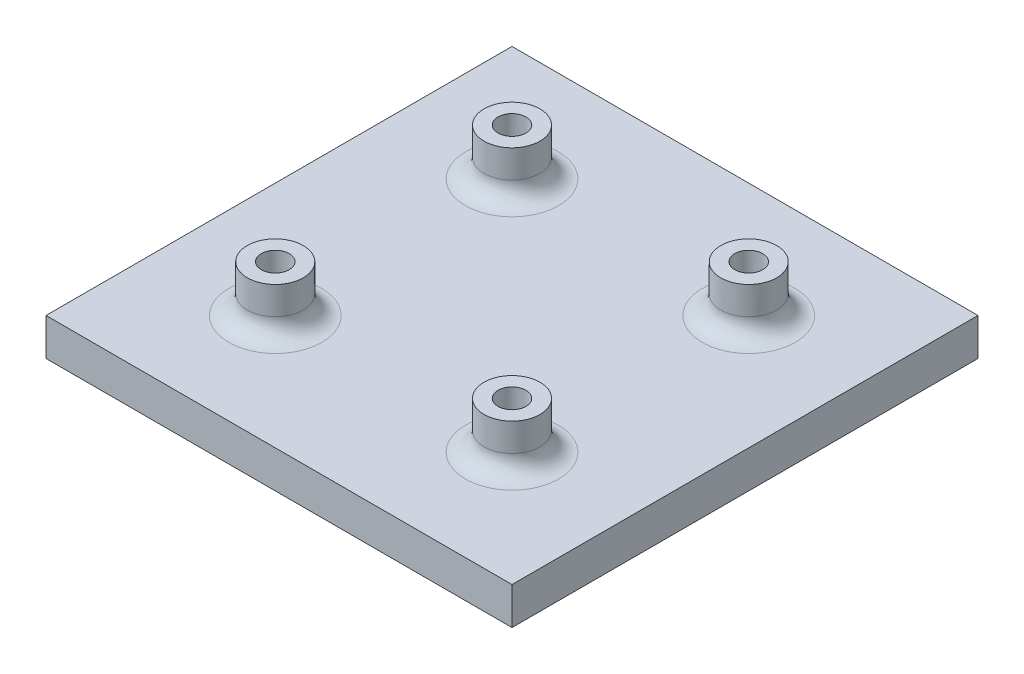
ISO-10303-21;
HEADER;
FILE_DESCRIPTION(('STEP AP214'),'2;1');
FILE_NAME('part.step','',(''),(''),'','','');
FILE_SCHEMA(('AUTOMOTIVE_DESIGN { 1 0 10303 214 1 1 1 1 }'));
ENDSEC;
DATA;
#1=APPLICATION_CONTEXT('core data for automotive mechanical design processes');
#2=APPLICATION_PROTOCOL_DEFINITION('international standard','automotive_design',2000,#1);
#3=PRODUCT_CONTEXT('',#1,'mechanical');
#4=PRODUCT('Part','Part','',(#3));
#5=PRODUCT_RELATED_PRODUCT_CATEGORY('part','',(#4));
#6=PRODUCT_DEFINITION_FORMATION('','',#4);
#7=PRODUCT_DEFINITION_CONTEXT('part definition',#1,'design');
#8=PRODUCT_DEFINITION('design','',#6,#7);
#9=PRODUCT_DEFINITION_SHAPE('','',#8);
#10=(LENGTH_UNIT() NAMED_UNIT(*) SI_UNIT(.MILLI.,.METRE.));
#11=(NAMED_UNIT(*) PLANE_ANGLE_UNIT() SI_UNIT($,.RADIAN.));
#12=(NAMED_UNIT(*) SI_UNIT($,.STERADIAN.) SOLID_ANGLE_UNIT());
#13=UNCERTAINTY_MEASURE_WITH_UNIT(LENGTH_MEASURE(1.E-05),#10,'distance_accuracy_value','');
#14=(GEOMETRIC_REPRESENTATION_CONTEXT(3) GLOBAL_UNCERTAINTY_ASSIGNED_CONTEXT((#13)) GLOBAL_UNIT_ASSIGNED_CONTEXT((#10,
#11,#12)) REPRESENTATION_CONTEXT('',''));
#15=CARTESIAN_POINT('',(0.,0.,0.));
#16=DIRECTION('',(0.,0.,1.));
#17=DIRECTION('',(1.,0.,0.));
#18=AXIS2_PLACEMENT_3D('',#15,#16,#17);
#19=CARTESIAN_POINT('',(12.3,0.,-37.7));
#20=DIRECTION('',(0.,1.,0.));
#21=DIRECTION('',(0.,0.,1.));
#22=AXIS2_PLACEMENT_3D('',#19,#20,#21);
#23=CYLINDRICAL_SURFACE('',#22,1.5);
#24=CARTESIAN_POINT('',(12.3,9.,-37.7));
#25=DIRECTION('',(0.,1.,0.));
#26=DIRECTION('',(0.,0.,1.));
#27=AXIS2_PLACEMENT_3D('',#24,#25,#26);
#28=CIRCLE('',#27,1.5);
#29=CARTESIAN_POINT('',(12.3,9.,-36.2));
#30=VERTEX_POINT('',#29);
#31=EDGE_CURVE('E169',#30,#30,#28,.T.);
#32=ORIENTED_EDGE('',*,*,#31,.T.);
#33=EDGE_LOOP('',(#32));
#34=FACE_BOUND('',#33,.T.);
#35=CARTESIAN_POINT('',(12.3,4.,-37.7));
#36=DIRECTION('',(0.,-1.,0.));
#37=DIRECTION('',(0.,0.,-1.));
#38=AXIS2_PLACEMENT_3D('',#35,#36,#37);
#39=CIRCLE('',#38,1.5);
#40=CARTESIAN_POINT('',(12.3,4.,-39.2));
#41=VERTEX_POINT('',#40);
#42=EDGE_CURVE('E11',#41,#41,#39,.F.);
#43=ORIENTED_EDGE('',*,*,#42,.F.);
#44=EDGE_LOOP('',(#43));
#45=FACE_BOUND('',#44,.T.);
#46=ADVANCED_FACE('F36',(#34,#45),#23,.F.);
#47=CARTESIAN_POINT('',(37.7,0.,-12.3));
#48=DIRECTION('',(0.,1.,0.));
#49=DIRECTION('',(0.,0.,1.));
#50=AXIS2_PLACEMENT_3D('',#47,#48,#49);
#51=CYLINDRICAL_SURFACE('',#50,1.5);
#52=CARTESIAN_POINT('',(37.7,9.,-12.3));
#53=DIRECTION('',(0.,1.,0.));
#54=DIRECTION('',(0.,0.,-1.));
#55=AXIS2_PLACEMENT_3D('',#52,#53,#54);
#56=CIRCLE('',#55,1.5);
#57=CARTESIAN_POINT('',(37.7,9.,-13.8));
#58=VERTEX_POINT('',#57);
#59=EDGE_CURVE('E157',#58,#58,#56,.T.);
#60=ORIENTED_EDGE('',*,*,#59,.T.);
#61=EDGE_LOOP('',(#60));
#62=FACE_BOUND('',#61,.T.);
#63=CARTESIAN_POINT('',(37.7,4.,-12.3));
#64=DIRECTION('',(0.,-1.,0.));
#65=DIRECTION('',(0.,0.,-1.));
#66=AXIS2_PLACEMENT_3D('',#63,#64,#65);
#67=CIRCLE('',#66,1.5);
#68=CARTESIAN_POINT('',(37.7,4.,-13.8));
#69=VERTEX_POINT('',#68);
#70=EDGE_CURVE('E46',#69,#69,#67,.F.);
#71=ORIENTED_EDGE('',*,*,#70,.F.);
#72=EDGE_LOOP('',(#71));
#73=FACE_BOUND('',#72,.T.);
#74=ADVANCED_FACE('F192',(#62,#73),#51,.F.);
#75=CARTESIAN_POINT('',(37.7,0.,-37.7));
#76=DIRECTION('',(0.,1.,0.));
#77=DIRECTION('',(0.,0.,1.));
#78=AXIS2_PLACEMENT_3D('',#75,#76,#77);
#79=CYLINDRICAL_SURFACE('',#78,1.5);
#80=CARTESIAN_POINT('',(37.7,9.,-37.7));
#81=DIRECTION('',(0.,-1.,0.));
#82=DIRECTION('',(0.,0.,1.));
#83=AXIS2_PLACEMENT_3D('',#80,#81,#82);
#84=CIRCLE('',#83,1.5);
#85=CARTESIAN_POINT('',(37.7,9.,-36.2));
#86=VERTEX_POINT('',#85);
#87=EDGE_CURVE('E151',#86,#86,#84,.T.);
#88=ORIENTED_EDGE('',*,*,#87,.F.);
#89=EDGE_LOOP('',(#88));
#90=FACE_BOUND('',#89,.T.);
#91=CARTESIAN_POINT('',(37.7,4.,-37.7));
#92=DIRECTION('',(0.,-1.,0.));
#93=DIRECTION('',(0.,0.,-1.));
#94=AXIS2_PLACEMENT_3D('',#91,#92,#93);
#95=CIRCLE('',#94,1.5);
#96=CARTESIAN_POINT('',(37.7,4.,-39.2));
#97=VERTEX_POINT('',#96);
#98=EDGE_CURVE('E142',#97,#97,#95,.F.);
#99=ORIENTED_EDGE('',*,*,#98,.F.);
#100=EDGE_LOOP('',(#99));
#101=FACE_BOUND('',#100,.T.);
#102=ADVANCED_FACE('F198',(#90,#101),#79,.F.);
#103=CARTESIAN_POINT('',(12.3,0.,-12.3));
#104=DIRECTION('',(0.,1.,0.));
#105=DIRECTION('',(0.,0.,1.));
#106=AXIS2_PLACEMENT_3D('',#103,#104,#105);
#107=CYLINDRICAL_SURFACE('',#106,1.5);
#108=CARTESIAN_POINT('',(12.3,9.,-12.3));
#109=DIRECTION('',(0.,-1.,0.));
#110=DIRECTION('',(0.,0.,-1.));
#111=AXIS2_PLACEMENT_3D('',#108,#109,#110);
#112=CIRCLE('',#111,1.5);
#113=CARTESIAN_POINT('',(12.3,9.,-13.8));
#114=VERTEX_POINT('',#113);
#115=EDGE_CURVE('E163',#114,#114,#112,.T.);
#116=ORIENTED_EDGE('',*,*,#115,.F.);
#117=EDGE_LOOP('',(#116));
#118=FACE_BOUND('',#117,.T.);
#119=CARTESIAN_POINT('',(12.3,4.,-12.3));
#120=DIRECTION('',(0.,-1.,0.));
#121=DIRECTION('',(0.,0.,-1.));
#122=AXIS2_PLACEMENT_3D('',#119,#120,#121);
#123=CIRCLE('',#122,1.5);
#124=CARTESIAN_POINT('',(12.3,4.,-13.8));
#125=VERTEX_POINT('',#124);
#126=EDGE_CURVE('E138',#125,#125,#123,.F.);
#127=ORIENTED_EDGE('',*,*,#126,.F.);
#128=EDGE_LOOP('',(#127));
#129=FACE_BOUND('',#128,.T.);
#130=ADVANCED_FACE('F207',(#118,#129),#107,.F.);
#131=CARTESIAN_POINT('',(0.,4.,0.));
#132=DIRECTION('',(0.,-1.,0.));
#133=DIRECTION('',(0.,0.,-1.));
#134=AXIS2_PLACEMENT_3D('',#131,#132,#133);
#135=PLANE('',#134);
#136=CARTESIAN_POINT('',(37.7,4.,-12.3));
#137=DIRECTION('',(0.,-1.,0.));
#138=DIRECTION('',(0.,0.,-1.));
#139=AXIS2_PLACEMENT_3D('',#136,#137,#138);
#140=CIRCLE('',#139,5.);
#141=CARTESIAN_POINT('',(37.7,4.,-17.3));
#142=VERTEX_POINT('',#141);
#143=EDGE_CURVE('E128',#142,#142,#140,.T.);
#144=ORIENTED_EDGE('',*,*,#143,.T.);
#145=EDGE_LOOP('',(#144));
#146=FACE_BOUND('',#145,.T.);
#147=CARTESIAN_POINT('',(37.7,4.,-37.7));
#148=DIRECTION('',(0.,-1.,0.));
#149=DIRECTION('',(0.,0.,-1.));
#150=AXIS2_PLACEMENT_3D('',#147,#148,#149);
#151=CIRCLE('',#150,5.);
#152=CARTESIAN_POINT('',(37.7,4.,-42.7));
#153=VERTEX_POINT('',#152);
#154=EDGE_CURVE('E125',#153,#153,#151,.T.);
#155=ORIENTED_EDGE('',*,*,#154,.T.);
#156=EDGE_LOOP('',(#155));
#157=FACE_BOUND('',#156,.T.);
#158=CARTESIAN_POINT('',(12.3,4.,-37.7));
#159=DIRECTION('',(0.,-1.,0.));
#160=DIRECTION('',(0.,0.,-1.));
#161=AXIS2_PLACEMENT_3D('',#158,#159,#160);
#162=CIRCLE('',#161,5.);
#163=CARTESIAN_POINT('',(12.3,4.,-42.7));
#164=VERTEX_POINT('',#163);
#165=EDGE_CURVE('E122',#164,#164,#162,.T.);
#166=ORIENTED_EDGE('',*,*,#165,.T.);
#167=EDGE_LOOP('',(#166));
#168=FACE_BOUND('',#167,.T.);
#169=CARTESIAN_POINT('',(12.3,4.,-12.3));
#170=DIRECTION('',(0.,-1.,0.));
#171=DIRECTION('',(0.,0.,-1.));
#172=AXIS2_PLACEMENT_3D('',#169,#170,#171);
#173=CIRCLE('',#172,5.);
#174=CARTESIAN_POINT('',(12.3,4.,-17.3));
#175=VERTEX_POINT('',#174);
#176=EDGE_CURVE('E119',#175,#175,#173,.T.);
#177=ORIENTED_EDGE('',*,*,#176,.T.);
#178=EDGE_LOOP('',(#177));
#179=FACE_BOUND('',#178,.T.);
#180=DIRECTION('',(0.,0.,1.));
#181=VECTOR('',#180,1.);
#182=CARTESIAN_POINT('',(0.,4.,0.));
#183=LINE('',#182,#181);
#184=CARTESIAN_POINT('',(0.,4.,-50.));
#185=VERTEX_POINT('',#184);
#186=CARTESIAN_POINT('',(0.,4.,0.));
#187=VERTEX_POINT('',#186);
#188=EDGE_CURVE('E91',#185,#187,#183,.T.);
#189=ORIENTED_EDGE('',*,*,#188,.T.);
#190=DIRECTION('',(1.,0.,0.));
#191=VECTOR('',#190,1.);
#192=CARTESIAN_POINT('',(0.,4.,0.));
#193=LINE('',#192,#191);
#194=CARTESIAN_POINT('',(50.,4.,0.));
#195=VERTEX_POINT('',#194);
#196=EDGE_CURVE('E86',#187,#195,#193,.T.);
#197=ORIENTED_EDGE('',*,*,#196,.T.);
#198=DIRECTION('',(0.,0.,-1.));
#199=VECTOR('',#198,1.);
#200=CARTESIAN_POINT('',(50.,4.,0.));
#201=LINE('',#200,#199);
#202=CARTESIAN_POINT('',(50.,4.,-50.));
#203=VERTEX_POINT('',#202);
#204=EDGE_CURVE('E89',#195,#203,#201,.T.);
#205=ORIENTED_EDGE('',*,*,#204,.T.);
#206=DIRECTION('',(-1.,0.,0.));
#207=VECTOR('',#206,1.);
#208=CARTESIAN_POINT('',(0.,4.,-50.));
#209=LINE('',#208,#207);
#210=EDGE_CURVE('E55',#203,#185,#209,.T.);
#211=ORIENTED_EDGE('',*,*,#210,.T.);
#212=EDGE_LOOP('',(#189,#197,#205,#211));
#213=FACE_BOUND('',#212,.T.);
#214=ADVANCED_FACE('F87',(#146,#157,#168,#179,#213),#135,.F.);
#215=CARTESIAN_POINT('',(0.,4.,0.));
#216=DIRECTION('',(1.,0.,0.));
#217=DIRECTION('',(0.,0.,-1.));
#218=AXIS2_PLACEMENT_3D('',#215,#216,#217);
#219=PLANE('',#218);
#220=DIRECTION('',(0.,0.,1.));
#221=VECTOR('',#220,1.);
#222=CARTESIAN_POINT('',(0.,0.,0.));
#223=LINE('',#222,#221);
#224=CARTESIAN_POINT('',(0.,0.,-50.));
#225=VERTEX_POINT('',#224);
#226=CARTESIAN_POINT('',(0.,0.,0.));
#227=VERTEX_POINT('',#226);
#228=EDGE_CURVE('E106',#225,#227,#223,.T.);
#229=ORIENTED_EDGE('',*,*,#228,.T.);
#230=DIRECTION('',(0.,-1.,0.));
#231=VECTOR('',#230,1.);
#232=CARTESIAN_POINT('',(0.,4.,0.));
#233=LINE('',#232,#231);
#234=EDGE_CURVE('E97',#187,#227,#233,.T.);
#235=ORIENTED_EDGE('',*,*,#234,.F.);
#236=ORIENTED_EDGE('',*,*,#188,.F.);
#237=DIRECTION('',(0.,-1.,0.));
#238=VECTOR('',#237,1.);
#239=CARTESIAN_POINT('',(0.,4.,-50.));
#240=LINE('',#239,#238);
#241=EDGE_CURVE('E102',#185,#225,#240,.T.);
#242=ORIENTED_EDGE('',*,*,#241,.T.);
#243=EDGE_LOOP('',(#229,#235,#236,#242));
#244=FACE_BOUND('',#243,.T.);
#245=ADVANCED_FACE('F206',(#244),#219,.F.);
#246=CARTESIAN_POINT('',(0.,4.,0.));
#247=DIRECTION('',(0.,0.,-1.));
#248=DIRECTION('',(-1.,0.,0.));
#249=AXIS2_PLACEMENT_3D('',#246,#247,#248);
#250=PLANE('',#249);
#251=DIRECTION('',(1.,0.,0.));
#252=VECTOR('',#251,1.);
#253=CARTESIAN_POINT('',(0.,0.,0.));
#254=LINE('',#253,#252);
#255=CARTESIAN_POINT('',(50.,0.,0.));
#256=VERTEX_POINT('',#255);
#257=EDGE_CURVE('E96',#227,#256,#254,.T.);
#258=ORIENTED_EDGE('',*,*,#257,.T.);
#259=DIRECTION('',(0.,-1.,0.));
#260=VECTOR('',#259,1.);
#261=CARTESIAN_POINT('',(50.,4.,0.));
#262=LINE('',#261,#260);
#263=EDGE_CURVE('E94',#195,#256,#262,.T.);
#264=ORIENTED_EDGE('',*,*,#263,.F.);
#265=ORIENTED_EDGE('',*,*,#196,.F.);
#266=ORIENTED_EDGE('',*,*,#234,.T.);
#267=EDGE_LOOP('',(#258,#264,#265,#266));
#268=FACE_BOUND('',#267,.T.);
#269=ADVANCED_FACE('F95',(#268),#250,.F.);
#270=CARTESIAN_POINT('',(50.,4.,0.));
#271=DIRECTION('',(-1.,0.,0.));
#272=DIRECTION('',(0.,0.,1.));
#273=AXIS2_PLACEMENT_3D('',#270,#271,#272);
#274=PLANE('',#273);
#275=DIRECTION('',(0.,0.,-1.));
#276=VECTOR('',#275,1.);
#277=CARTESIAN_POINT('',(50.,0.,0.));
#278=LINE('',#277,#276);
#279=CARTESIAN_POINT('',(50.,0.,-50.));
#280=VERTEX_POINT('',#279);
#281=EDGE_CURVE('E72',#256,#280,#278,.T.);
#282=ORIENTED_EDGE('',*,*,#281,.T.);
#283=DIRECTION('',(0.,-1.,0.));
#284=VECTOR('',#283,1.);
#285=CARTESIAN_POINT('',(50.,4.,-50.));
#286=LINE('',#285,#284);
#287=EDGE_CURVE('E98',#203,#280,#286,.T.);
#288=ORIENTED_EDGE('',*,*,#287,.F.);
#289=ORIENTED_EDGE('',*,*,#204,.F.);
#290=ORIENTED_EDGE('',*,*,#263,.T.);
#291=EDGE_LOOP('',(#282,#288,#289,#290));
#292=FACE_BOUND('',#291,.T.);
#293=ADVANCED_FACE('F100',(#292),#274,.F.);
#294=CARTESIAN_POINT('',(0.,4.,-50.));
#295=DIRECTION('',(0.,0.,1.));
#296=DIRECTION('',(1.,0.,0.));
#297=AXIS2_PLACEMENT_3D('',#294,#295,#296);
#298=PLANE('',#297);
#299=DIRECTION('',(-1.,0.,0.));
#300=VECTOR('',#299,1.);
#301=CARTESIAN_POINT('',(0.,0.,-50.));
#302=LINE('',#301,#300);
#303=EDGE_CURVE('E78',#280,#225,#302,.T.);
#304=ORIENTED_EDGE('',*,*,#303,.T.);
#305=ORIENTED_EDGE('',*,*,#241,.F.);
#306=ORIENTED_EDGE('',*,*,#210,.F.);
#307=ORIENTED_EDGE('',*,*,#287,.T.);
#308=EDGE_LOOP('',(#304,#305,#306,#307));
#309=FACE_BOUND('',#308,.T.);
#310=ADVANCED_FACE('F211',(#309),#298,.F.);
#311=CARTESIAN_POINT('',(0.,0.,0.));
#312=DIRECTION('',(0.,-1.,0.));
#313=DIRECTION('',(0.,0.,-1.));
#314=AXIS2_PLACEMENT_3D('',#311,#312,#313);
#315=PLANE('',#314);
#316=ORIENTED_EDGE('',*,*,#228,.F.);
#317=ORIENTED_EDGE('',*,*,#303,.F.);
#318=ORIENTED_EDGE('',*,*,#281,.F.);
#319=ORIENTED_EDGE('',*,*,#257,.F.);
#320=EDGE_LOOP('',(#316,#317,#318,#319));
#321=FACE_BOUND('',#320,.T.);
#322=ADVANCED_FACE('F188',(#321),#315,.T.);
#323=CARTESIAN_POINT('',(12.3,9.,-37.7));
#324=DIRECTION('',(0.,1.,0.));
#325=DIRECTION('',(0.,0.,1.));
#326=AXIS2_PLACEMENT_3D('',#323,#324,#325);
#327=PLANE('',#326);
#328=CARTESIAN_POINT('',(12.3,9.,-37.7));
#329=DIRECTION('',(0.,1.,0.));
#330=DIRECTION('',(0.,0.,1.));
#331=AXIS2_PLACEMENT_3D('',#328,#329,#330);
#332=CIRCLE('',#331,3.);
#333=CARTESIAN_POINT('',(12.3,9.,-34.7));
#334=VERTEX_POINT('',#333);
#335=EDGE_CURVE('E109',#334,#334,#332,.T.);
#336=ORIENTED_EDGE('',*,*,#335,.T.);
#337=EDGE_LOOP('',(#336));
#338=FACE_BOUND('',#337,.T.);
#339=ORIENTED_EDGE('',*,*,#31,.F.);
#340=EDGE_LOOP('',(#339));
#341=FACE_BOUND('',#340,.T.);
#342=ADVANCED_FACE('F175',(#338,#341),#327,.T.);
#343=CARTESIAN_POINT('',(12.3,9.,-37.7));
#344=DIRECTION('',(0.,-1.,0.));
#345=DIRECTION('',(0.,0.,-1.));
#346=AXIS2_PLACEMENT_3D('',#343,#344,#345);
#347=CYLINDRICAL_SURFACE('',#346,3.);
#348=CARTESIAN_POINT('',(12.3,6.,-37.7));
#349=DIRECTION('',(0.,-1.,0.));
#350=DIRECTION('',(0.,0.,-1.));
#351=AXIS2_PLACEMENT_3D('',#348,#349,#350);
#352=CIRCLE('',#351,3.);
#353=CARTESIAN_POINT('',(12.3,6.,-40.7));
#354=VERTEX_POINT('',#353);
#355=EDGE_CURVE('E133',#354,#354,#352,.F.);
#356=ORIENTED_EDGE('',*,*,#355,.T.);
#357=EDGE_LOOP('',(#356));
#358=FACE_BOUND('',#357,.T.);
#359=ORIENTED_EDGE('',*,*,#335,.F.);
#360=EDGE_LOOP('',(#359));
#361=FACE_BOUND('',#360,.T.);
#362=ADVANCED_FACE('F178',(#358,#361),#347,.T.);
#363=CARTESIAN_POINT('',(12.3,9.,-12.3));
#364=DIRECTION('',(0.,-1.,0.));
#365=DIRECTION('',(0.,0.,-1.));
#366=AXIS2_PLACEMENT_3D('',#363,#364,#365);
#367=CYLINDRICAL_SURFACE('',#366,3.);
#368=CARTESIAN_POINT('',(12.3,6.,-12.3));
#369=DIRECTION('',(0.,-1.,0.));
#370=DIRECTION('',(0.,0.,-1.));
#371=AXIS2_PLACEMENT_3D('',#368,#369,#370);
#372=CIRCLE('',#371,3.);
#373=CARTESIAN_POINT('',(12.3,6.,-15.3));
#374=VERTEX_POINT('',#373);
#375=EDGE_CURVE('E40',#374,#374,#372,.F.);
#376=ORIENTED_EDGE('',*,*,#375,.T.);
#377=EDGE_LOOP('',(#376));
#378=FACE_BOUND('',#377,.T.);
#379=CARTESIAN_POINT('',(12.3,9.,-12.3));
#380=DIRECTION('',(0.,-1.,0.));
#381=DIRECTION('',(0.,0.,-1.));
#382=AXIS2_PLACEMENT_3D('',#379,#380,#381);
#383=CIRCLE('',#382,3.);
#384=CARTESIAN_POINT('',(12.3,9.,-15.3));
#385=VERTEX_POINT('',#384);
#386=EDGE_CURVE('E166',#385,#385,#383,.T.);
#387=ORIENTED_EDGE('',*,*,#386,.T.);
#388=EDGE_LOOP('',(#387));
#389=FACE_BOUND('',#388,.T.);
#390=ADVANCED_FACE('F180',(#378,#389),#367,.T.);
#391=CARTESIAN_POINT('',(12.3,9.,-12.3));
#392=DIRECTION('',(0.,1.,0.));
#393=DIRECTION('',(0.,0.,-1.));
#394=AXIS2_PLACEMENT_3D('',#391,#392,#393);
#395=PLANE('',#394);
#396=ORIENTED_EDGE('',*,*,#115,.T.);
#397=EDGE_LOOP('',(#396));
#398=FACE_BOUND('',#397,.T.);
#399=ORIENTED_EDGE('',*,*,#386,.F.);
#400=EDGE_LOOP('',(#399));
#401=FACE_BOUND('',#400,.T.);
#402=ADVANCED_FACE('F186',(#398,#401),#395,.T.);
#403=CARTESIAN_POINT('',(37.7,9.,-12.3));
#404=DIRECTION('',(0.,1.,0.));
#405=DIRECTION('',(0.,0.,-1.));
#406=AXIS2_PLACEMENT_3D('',#403,#404,#405);
#407=PLANE('',#406);
#408=CARTESIAN_POINT('',(37.7,9.,-12.3));
#409=DIRECTION('',(0.,1.,0.));
#410=DIRECTION('',(0.,0.,-1.));
#411=AXIS2_PLACEMENT_3D('',#408,#409,#410);
#412=CIRCLE('',#411,3.);
#413=CARTESIAN_POINT('',(37.7,9.,-15.3));
#414=VERTEX_POINT('',#413);
#415=EDGE_CURVE('E160',#414,#414,#412,.T.);
#416=ORIENTED_EDGE('',*,*,#415,.T.);
#417=EDGE_LOOP('',(#416));
#418=FACE_BOUND('',#417,.T.);
#419=ORIENTED_EDGE('',*,*,#59,.F.);
#420=EDGE_LOOP('',(#419));
#421=FACE_BOUND('',#420,.T.);
#422=ADVANCED_FACE('F354',(#418,#421),#407,.T.);
#423=CARTESIAN_POINT('',(37.7,9.,-12.3));
#424=DIRECTION('',(0.,-1.,0.));
#425=DIRECTION('',(0.,0.,-1.));
#426=AXIS2_PLACEMENT_3D('',#423,#424,#425);
#427=CYLINDRICAL_SURFACE('',#426,3.);
#428=CARTESIAN_POINT('',(37.7,6.,-12.3));
#429=DIRECTION('',(0.,-1.,0.));
#430=DIRECTION('',(0.,0.,-1.));
#431=AXIS2_PLACEMENT_3D('',#428,#429,#430);
#432=CIRCLE('',#431,3.);
#433=CARTESIAN_POINT('',(37.7,6.,-15.3));
#434=VERTEX_POINT('',#433);
#435=EDGE_CURVE('E116',#434,#434,#432,.F.);
#436=ORIENTED_EDGE('',*,*,#435,.T.);
#437=EDGE_LOOP('',(#436));
#438=FACE_BOUND('',#437,.T.);
#439=ORIENTED_EDGE('',*,*,#415,.F.);
#440=EDGE_LOOP('',(#439));
#441=FACE_BOUND('',#440,.T.);
#442=ADVANCED_FACE('F344',(#438,#441),#427,.T.);
#443=CARTESIAN_POINT('',(37.7,9.,-37.7));
#444=DIRECTION('',(0.,-1.,0.));
#445=DIRECTION('',(0.,0.,-1.));
#446=AXIS2_PLACEMENT_3D('',#443,#444,#445);
#447=CYLINDRICAL_SURFACE('',#446,3.);
#448=CARTESIAN_POINT('',(37.7,6.,-37.7));
#449=DIRECTION('',(0.,-1.,0.));
#450=DIRECTION('',(0.,0.,-1.));
#451=AXIS2_PLACEMENT_3D('',#448,#449,#450);
#452=CIRCLE('',#451,3.);
#453=CARTESIAN_POINT('',(37.7,6.,-40.7));
#454=VERTEX_POINT('',#453);
#455=EDGE_CURVE('E131',#454,#454,#452,.F.);
#456=ORIENTED_EDGE('',*,*,#455,.T.);
#457=EDGE_LOOP('',(#456));
#458=FACE_BOUND('',#457,.T.);
#459=CARTESIAN_POINT('',(37.7,9.,-37.7));
#460=DIRECTION('',(0.,-1.,0.));
#461=DIRECTION('',(0.,0.,1.));
#462=AXIS2_PLACEMENT_3D('',#459,#460,#461);
#463=CIRCLE('',#462,3.);
#464=CARTESIAN_POINT('',(37.7,9.,-34.7));
#465=VERTEX_POINT('',#464);
#466=EDGE_CURVE('E154',#465,#465,#463,.T.);
#467=ORIENTED_EDGE('',*,*,#466,.T.);
#468=EDGE_LOOP('',(#467));
#469=FACE_BOUND('',#468,.T.);
#470=ADVANCED_FACE('F339',(#458,#469),#447,.T.);
#471=CARTESIAN_POINT('',(37.7,9.,-37.7));
#472=DIRECTION('',(0.,1.,0.));
#473=DIRECTION('',(0.,0.,1.));
#474=AXIS2_PLACEMENT_3D('',#471,#472,#473);
#475=PLANE('',#474);
#476=ORIENTED_EDGE('',*,*,#87,.T.);
#477=EDGE_LOOP('',(#476));
#478=FACE_BOUND('',#477,.T.);
#479=ORIENTED_EDGE('',*,*,#466,.F.);
#480=EDGE_LOOP('',(#479));
#481=FACE_BOUND('',#480,.T.);
#482=ADVANCED_FACE('F226',(#478,#481),#475,.T.);
#483=CARTESIAN_POINT('',(37.7,6.,-12.3));
#484=DIRECTION('',(0.,-1.,0.));
#485=DIRECTION('',(0.,0.,-1.));
#486=AXIS2_PLACEMENT_3D('',#483,#484,#485);
#487=TOROIDAL_SURFACE('',#486,5.,2.);
#488=ORIENTED_EDGE('',*,*,#143,.F.);
#489=EDGE_LOOP('',(#488));
#490=FACE_BOUND('',#489,.T.);
#491=ORIENTED_EDGE('',*,*,#435,.F.);
#492=EDGE_LOOP('',(#491));
#493=FACE_BOUND('',#492,.T.);
#494=ADVANCED_FACE('F222',(#490,#493),#487,.F.);
#495=CARTESIAN_POINT('',(37.7,6.,-37.7));
#496=DIRECTION('',(0.,-1.,0.));
#497=DIRECTION('',(0.,0.,-1.));
#498=AXIS2_PLACEMENT_3D('',#495,#496,#497);
#499=TOROIDAL_SURFACE('',#498,5.,2.);
#500=ORIENTED_EDGE('',*,*,#455,.F.);
#501=EDGE_LOOP('',(#500));
#502=FACE_BOUND('',#501,.T.);
#503=ORIENTED_EDGE('',*,*,#154,.F.);
#504=EDGE_LOOP('',(#503));
#505=FACE_BOUND('',#504,.T.);
#506=ADVANCED_FACE('F225',(#502,#505),#499,.F.);
#507=CARTESIAN_POINT('',(12.3,6.,-37.7));
#508=DIRECTION('',(0.,-1.,0.));
#509=DIRECTION('',(0.,0.,-1.));
#510=AXIS2_PLACEMENT_3D('',#507,#508,#509);
#511=TOROIDAL_SURFACE('',#510,5.,2.);
#512=ORIENTED_EDGE('',*,*,#165,.F.);
#513=EDGE_LOOP('',(#512));
#514=FACE_BOUND('',#513,.T.);
#515=ORIENTED_EDGE('',*,*,#355,.F.);
#516=EDGE_LOOP('',(#515));
#517=FACE_BOUND('',#516,.T.);
#518=ADVANCED_FACE('F229',(#514,#517),#511,.F.);
#519=CARTESIAN_POINT('',(12.3,6.,-12.3));
#520=DIRECTION('',(0.,-1.,0.));
#521=DIRECTION('',(0.,0.,-1.));
#522=AXIS2_PLACEMENT_3D('',#519,#520,#521);
#523=TOROIDAL_SURFACE('',#522,5.,2.);
#524=ORIENTED_EDGE('',*,*,#375,.F.);
#525=EDGE_LOOP('',(#524));
#526=FACE_BOUND('',#525,.T.);
#527=ORIENTED_EDGE('',*,*,#176,.F.);
#528=EDGE_LOOP('',(#527));
#529=FACE_BOUND('',#528,.T.);
#530=ADVANCED_FACE('F38',(#526,#529),#523,.F.);
#531=CARTESIAN_POINT('',(0.,4.,0.));
#532=DIRECTION('',(0.,-1.,0.));
#533=DIRECTION('',(0.,0.,-1.));
#534=AXIS2_PLACEMENT_3D('',#531,#532,#533);
#535=PLANE('',#534);
#536=ORIENTED_EDGE('',*,*,#126,.T.);
#537=EDGE_LOOP('',(#536));
#538=FACE_BOUND('',#537,.T.);
#539=ADVANCED_FACE('F236',(#538),#535,.F.);
#540=ORIENTED_EDGE('',*,*,#98,.T.);
#541=EDGE_LOOP('',(#540));
#542=FACE_BOUND('',#541,.T.);
#543=ADVANCED_FACE('F247',(#542),#535,.F.);
#544=ORIENTED_EDGE('',*,*,#70,.T.);
#545=EDGE_LOOP('',(#544));
#546=FACE_BOUND('',#545,.T.);
#547=ADVANCED_FACE('F253',(#546),#535,.F.);
#548=ORIENTED_EDGE('',*,*,#42,.T.);
#549=EDGE_LOOP('',(#548));
#550=FACE_BOUND('',#549,.T.);
#551=ADVANCED_FACE('F249',(#550),#535,.F.);
#552=CLOSED_SHELL('',(#46,#74,#102,#130,#214,#245,#269,#293,#310,#322,#342,#362,#390,#402,#422,
#442,#470,#482,#494,#506,#518,#530,#539,#543,#547,#551));
#553=MANIFOLD_SOLID_BREP('B2',#552);
#554=ADVANCED_BREP_SHAPE_REPRESENTATION('',(#18,#553),#14);
#555=SHAPE_DEFINITION_REPRESENTATION(#9,#554);
ENDSEC;
END-ISO-10303-21;
